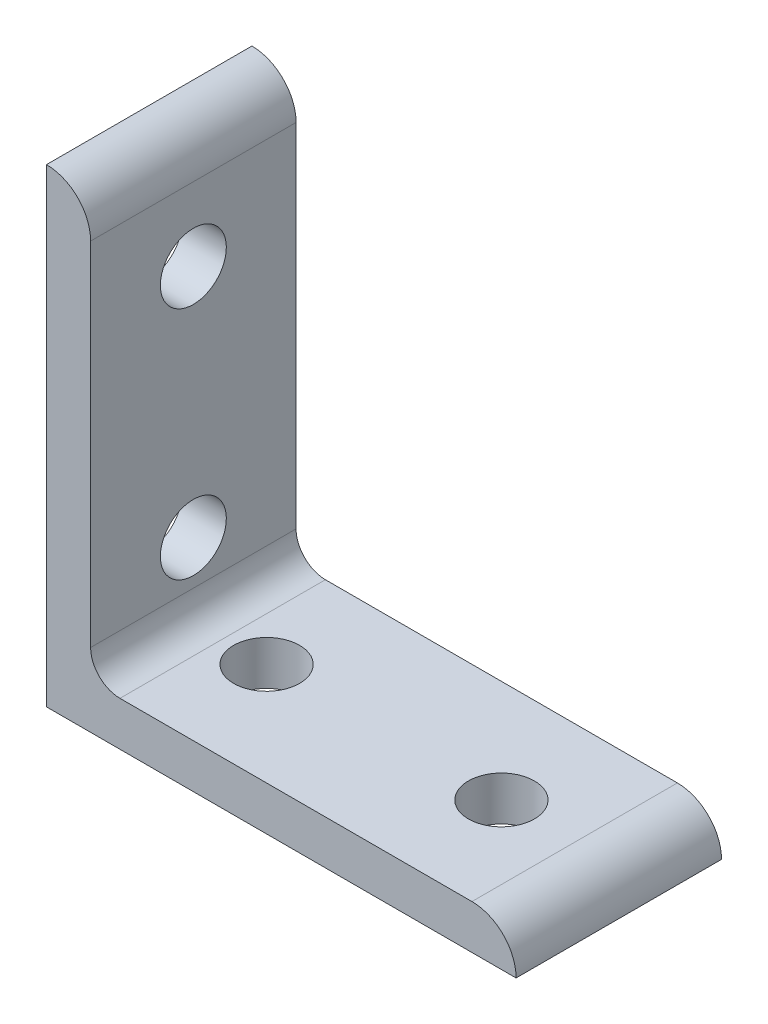
ISO-10303-21;
HEADER;
FILE_DESCRIPTION(('STEP AP214'),'2;1');
FILE_NAME('part.step','',(''),(''),'','','');
FILE_SCHEMA(('AUTOMOTIVE_DESIGN { 1 0 10303 214 1 1 1 1 }'));
ENDSEC;
DATA;
#1=APPLICATION_CONTEXT('core data for automotive mechanical design processes');
#2=APPLICATION_PROTOCOL_DEFINITION('international standard','automotive_design',2000,#1);
#3=PRODUCT_CONTEXT('',#1,'mechanical');
#4=PRODUCT('Part','Part','',(#3));
#5=PRODUCT_RELATED_PRODUCT_CATEGORY('part','',(#4));
#6=PRODUCT_DEFINITION_FORMATION('','',#4);
#7=PRODUCT_DEFINITION_CONTEXT('part definition',#1,'design');
#8=PRODUCT_DEFINITION('design','',#6,#7);
#9=PRODUCT_DEFINITION_SHAPE('','',#8);
#10=(LENGTH_UNIT() NAMED_UNIT(*) SI_UNIT(.MILLI.,.METRE.));
#11=(NAMED_UNIT(*) PLANE_ANGLE_UNIT() SI_UNIT($,.RADIAN.));
#12=(NAMED_UNIT(*) SI_UNIT($,.STERADIAN.) SOLID_ANGLE_UNIT());
#13=UNCERTAINTY_MEASURE_WITH_UNIT(LENGTH_MEASURE(1.E-05),#10,'distance_accuracy_value','');
#14=(GEOMETRIC_REPRESENTATION_CONTEXT(3) GLOBAL_UNCERTAINTY_ASSIGNED_CONTEXT((#13)) GLOBAL_UNIT_ASSIGNED_CONTEXT((#10,
#11,#12)) REPRESENTATION_CONTEXT('',''));
#15=CARTESIAN_POINT('',(0.,0.,0.));
#16=DIRECTION('',(0.,0.,1.));
#17=DIRECTION('',(1.,0.,0.));
#18=AXIS2_PLACEMENT_3D('',#15,#16,#17);
#19=CARTESIAN_POINT('',(4.7752,46.0248,11.1125));
#20=DIRECTION('',(-1.,0.,0.));
#21=DIRECTION('',(0.,-1.,0.));
#22=AXIS2_PLACEMENT_3D('',#19,#20,#21);
#23=PLANE('',#22);
#24=CARTESIAN_POINT('',(4.7752,12.7,0.));
#25=DIRECTION('',(-1.,0.,0.));
#26=DIRECTION('',(0.,-1.,0.));
#27=AXIS2_PLACEMENT_3D('',#24,#25,#26);
#28=CIRCLE('',#27,3.5687);
#29=CARTESIAN_POINT('',(4.7752,9.1313,0.));
#30=VERTEX_POINT('',#29);
#31=EDGE_CURVE('E199',#30,#30,#28,.F.);
#32=ORIENTED_EDGE('',*,*,#31,.F.);
#33=EDGE_LOOP('',(#32));
#34=FACE_BOUND('',#33,.T.);
#35=DIRECTION('',(0.,1.,0.));
#36=VECTOR('',#35,1.);
#37=CARTESIAN_POINT('',(4.7752,46.0248,-11.1125));
#38=LINE('',#37,#36);
#39=CARTESIAN_POINT('',(4.7752,7.9502,-11.1125));
#40=VERTEX_POINT('',#39);
#41=CARTESIAN_POINT('',(4.77519999999999,46.0248,-11.1125));
#42=VERTEX_POINT('',#41);
#43=EDGE_CURVE('E120',#40,#42,#38,.T.);
#44=ORIENTED_EDGE('',*,*,#43,.T.);
#45=DIRECTION('',(0.,0.,-1.));
#46=VECTOR('',#45,1.);
#47=CARTESIAN_POINT('',(4.77519999999999,46.0248,11.1125));
#48=LINE('',#47,#46);
#49=CARTESIAN_POINT('',(4.77519999999999,46.0248,11.1125));
#50=VERTEX_POINT('',#49);
#51=EDGE_CURVE('E117',#50,#42,#48,.T.);
#52=ORIENTED_EDGE('',*,*,#51,.F.);
#53=DIRECTION('',(0.,1.,0.));
#54=VECTOR('',#53,1.);
#55=CARTESIAN_POINT('',(4.7752,46.0248,11.1125));
#56=LINE('',#55,#54);
#57=CARTESIAN_POINT('',(4.7752,7.9502,11.1125));
#58=VERTEX_POINT('',#57);
#59=EDGE_CURVE('E106',#58,#50,#56,.T.);
#60=ORIENTED_EDGE('',*,*,#59,.F.);
#61=DIRECTION('',(0.,0.,-1.));
#62=VECTOR('',#61,1.);
#63=CARTESIAN_POINT('',(4.7752,7.9502,11.1125));
#64=LINE('',#63,#62);
#65=EDGE_CURVE('E121',#58,#40,#64,.T.);
#66=ORIENTED_EDGE('',*,*,#65,.T.);
#67=EDGE_LOOP('',(#44,#52,#60,#66));
#68=FACE_BOUND('',#67,.T.);
#69=CARTESIAN_POINT('',(4.77519999999999,38.1,0.));
#70=DIRECTION('',(-1.,0.,0.));
#71=DIRECTION('',(0.,-1.,0.));
#72=AXIS2_PLACEMENT_3D('',#69,#70,#71);
#73=CIRCLE('',#72,3.5687);
#74=CARTESIAN_POINT('',(4.77519999999999,34.5313,0.));
#75=VERTEX_POINT('',#74);
#76=EDGE_CURVE('E192',#75,#75,#73,.F.);
#77=ORIENTED_EDGE('',*,*,#76,.F.);
#78=EDGE_LOOP('',(#77));
#79=FACE_BOUND('',#78,.T.);
#80=ADVANCED_FACE('F37',(#34,#68,#79),#23,.F.);
#81=CARTESIAN_POINT('',(0.,0.,11.1125));
#82=DIRECTION('',(1.,0.,0.));
#83=DIRECTION('',(0.,0.,-1.));
#84=AXIS2_PLACEMENT_3D('',#81,#82,#83);
#85=PLANE('',#84);
#86=CARTESIAN_POINT('',(0.,12.7,0.));
#87=DIRECTION('',(1.,0.,0.));
#88=DIRECTION('',(0.,0.,-1.));
#89=AXIS2_PLACEMENT_3D('',#86,#87,#88);
#90=CIRCLE('',#89,3.5687);
#91=CARTESIAN_POINT('',(0.,12.7,-3.5687));
#92=VERTEX_POINT('',#91);
#93=EDGE_CURVE('E195',#92,#92,#90,.T.);
#94=ORIENTED_EDGE('',*,*,#93,.T.);
#95=EDGE_LOOP('',(#94));
#96=FACE_BOUND('',#95,.T.);
#97=DIRECTION('',(0.,-1.,0.));
#98=VECTOR('',#97,1.);
#99=CARTESIAN_POINT('',(0.,0.,-11.1125));
#100=LINE('',#99,#98);
#101=CARTESIAN_POINT('',(0.,50.8,-11.1125));
#102=VERTEX_POINT('',#101);
#103=CARTESIAN_POINT('',(0.,0.,-11.1125));
#104=VERTEX_POINT('',#103);
#105=EDGE_CURVE('E88',#102,#104,#100,.T.);
#106=ORIENTED_EDGE('',*,*,#105,.T.);
#107=DIRECTION('',(0.,0.,-1.));
#108=VECTOR('',#107,1.);
#109=CARTESIAN_POINT('',(0.,0.,11.1125));
#110=LINE('',#109,#108);
#111=CARTESIAN_POINT('',(0.,0.,11.1125));
#112=VERTEX_POINT('',#111);
#113=EDGE_CURVE('E126',#112,#104,#110,.T.);
#114=ORIENTED_EDGE('',*,*,#113,.F.);
#115=DIRECTION('',(0.,-1.,0.));
#116=VECTOR('',#115,1.);
#117=CARTESIAN_POINT('',(0.,0.,11.1125));
#118=LINE('',#117,#116);
#119=CARTESIAN_POINT('',(0.,50.8,11.1125));
#120=VERTEX_POINT('',#119);
#121=EDGE_CURVE('E56',#120,#112,#118,.T.);
#122=ORIENTED_EDGE('',*,*,#121,.F.);
#123=DIRECTION('',(0.,0.,-1.));
#124=VECTOR('',#123,1.);
#125=CARTESIAN_POINT('',(0.,50.8,11.1125));
#126=LINE('',#125,#124);
#127=EDGE_CURVE('E122',#120,#102,#126,.T.);
#128=ORIENTED_EDGE('',*,*,#127,.T.);
#129=EDGE_LOOP('',(#106,#114,#122,#128));
#130=FACE_BOUND('',#129,.T.);
#131=CARTESIAN_POINT('',(0.,38.1,0.));
#132=DIRECTION('',(1.,0.,0.));
#133=DIRECTION('',(0.,0.,-1.));
#134=AXIS2_PLACEMENT_3D('',#131,#132,#133);
#135=CIRCLE('',#134,3.5687);
#136=CARTESIAN_POINT('',(0.,38.1,-3.5687));
#137=VERTEX_POINT('',#136);
#138=EDGE_CURVE('E190',#137,#137,#135,.T.);
#139=ORIENTED_EDGE('',*,*,#138,.T.);
#140=EDGE_LOOP('',(#139));
#141=FACE_BOUND('',#140,.T.);
#142=ADVANCED_FACE('F183',(#96,#130,#141),#85,.F.);
#143=CARTESIAN_POINT('',(50.8,0.,11.1125));
#144=DIRECTION('',(0.,1.,0.));
#145=DIRECTION('',(-1.,0.,0.));
#146=AXIS2_PLACEMENT_3D('',#143,#144,#145);
#147=PLANE('',#146);
#148=CARTESIAN_POINT('',(12.7,0.,0.));
#149=DIRECTION('',(0.,1.,0.));
#150=DIRECTION('',(0.,0.,1.));
#151=AXIS2_PLACEMENT_3D('',#148,#149,#150);
#152=CIRCLE('',#151,3.5687);
#153=CARTESIAN_POINT('',(12.7,0.,3.5687));
#154=VERTEX_POINT('',#153);
#155=EDGE_CURVE('E152',#154,#154,#152,.T.);
#156=ORIENTED_EDGE('',*,*,#155,.T.);
#157=EDGE_LOOP('',(#156));
#158=FACE_BOUND('',#157,.T.);
#159=DIRECTION('',(1.,0.,0.));
#160=VECTOR('',#159,1.);
#161=CARTESIAN_POINT('',(50.8,0.,-11.1125));
#162=LINE('',#161,#160);
#163=CARTESIAN_POINT('',(50.8,0.,-11.1125));
#164=VERTEX_POINT('',#163);
#165=EDGE_CURVE('E130',#104,#164,#162,.T.);
#166=ORIENTED_EDGE('',*,*,#165,.T.);
#167=DIRECTION('',(0.,0.,-1.));
#168=VECTOR('',#167,1.);
#169=CARTESIAN_POINT('',(50.8,0.,11.1125));
#170=LINE('',#169,#168);
#171=CARTESIAN_POINT('',(50.8,0.,11.1125));
#172=VERTEX_POINT('',#171);
#173=EDGE_CURVE('E11',#172,#164,#170,.T.);
#174=ORIENTED_EDGE('',*,*,#173,.F.);
#175=DIRECTION('',(1.,0.,0.));
#176=VECTOR('',#175,1.);
#177=CARTESIAN_POINT('',(50.8,0.,11.1125));
#178=LINE('',#177,#176);
#179=EDGE_CURVE('E143',#112,#172,#178,.T.);
#180=ORIENTED_EDGE('',*,*,#179,.F.);
#181=ORIENTED_EDGE('',*,*,#113,.T.);
#182=EDGE_LOOP('',(#166,#174,#180,#181));
#183=FACE_BOUND('',#182,.T.);
#184=CARTESIAN_POINT('',(38.1,0.,0.));
#185=DIRECTION('',(0.,1.,0.));
#186=DIRECTION('',(0.,0.,1.));
#187=AXIS2_PLACEMENT_3D('',#184,#185,#186);
#188=CIRCLE('',#187,3.56869999999999);
#189=CARTESIAN_POINT('',(38.1,0.,3.56869999999999));
#190=VERTEX_POINT('',#189);
#191=EDGE_CURVE('E160',#190,#190,#188,.T.);
#192=ORIENTED_EDGE('',*,*,#191,.T.);
#193=EDGE_LOOP('',(#192));
#194=FACE_BOUND('',#193,.T.);
#195=ADVANCED_FACE('F39',(#158,#183,#194),#147,.F.);
#196=CARTESIAN_POINT('',(7.9502,4.7752,11.1125));
#197=DIRECTION('',(0.,-1.,0.));
#198=DIRECTION('',(1.,0.,0.));
#199=AXIS2_PLACEMENT_3D('',#196,#197,#198);
#200=PLANE('',#199);
#201=CARTESIAN_POINT('',(12.7,4.7752,0.));
#202=DIRECTION('',(0.,-1.,0.));
#203=DIRECTION('',(1.,0.,0.));
#204=AXIS2_PLACEMENT_3D('',#201,#202,#203);
#205=CIRCLE('',#204,3.5687);
#206=CARTESIAN_POINT('',(16.2687,4.7752,0.));
#207=VERTEX_POINT('',#206);
#208=EDGE_CURVE('E134',#207,#207,#205,.F.);
#209=ORIENTED_EDGE('',*,*,#208,.F.);
#210=EDGE_LOOP('',(#209));
#211=FACE_BOUND('',#210,.T.);
#212=DIRECTION('',(-1.,0.,0.));
#213=VECTOR('',#212,1.);
#214=CARTESIAN_POINT('',(7.9502,4.7752,-11.1125));
#215=LINE('',#214,#213);
#216=CARTESIAN_POINT('',(46.0248,4.7752,-11.1125));
#217=VERTEX_POINT('',#216);
#218=CARTESIAN_POINT('',(7.9502,4.7752,-11.1125));
#219=VERTEX_POINT('',#218);
#220=EDGE_CURVE('E136',#217,#219,#215,.T.);
#221=ORIENTED_EDGE('',*,*,#220,.T.);
#222=DIRECTION('',(0.,0.,-1.));
#223=VECTOR('',#222,1.);
#224=CARTESIAN_POINT('',(7.9502,4.7752,11.1125));
#225=LINE('',#224,#223);
#226=CARTESIAN_POINT('',(7.9502,4.7752,11.1125));
#227=VERTEX_POINT('',#226);
#228=EDGE_CURVE('E147',#227,#219,#225,.T.);
#229=ORIENTED_EDGE('',*,*,#228,.F.);
#230=DIRECTION('',(-1.,0.,0.));
#231=VECTOR('',#230,1.);
#232=CARTESIAN_POINT('',(7.9502,4.7752,11.1125));
#233=LINE('',#232,#231);
#234=CARTESIAN_POINT('',(46.0248,4.7752,11.1125));
#235=VERTEX_POINT('',#234);
#236=EDGE_CURVE('E166',#235,#227,#233,.T.);
#237=ORIENTED_EDGE('',*,*,#236,.F.);
#238=DIRECTION('',(0.,0.,-1.));
#239=VECTOR('',#238,1.);
#240=CARTESIAN_POINT('',(46.0248,4.7752,11.1125));
#241=LINE('',#240,#239);
#242=EDGE_CURVE('E47',#235,#217,#241,.T.);
#243=ORIENTED_EDGE('',*,*,#242,.T.);
#244=EDGE_LOOP('',(#221,#229,#237,#243));
#245=FACE_BOUND('',#244,.T.);
#246=CARTESIAN_POINT('',(38.1,4.7752,0.));
#247=DIRECTION('',(0.,-1.,0.));
#248=DIRECTION('',(1.,0.,0.));
#249=AXIS2_PLACEMENT_3D('',#246,#247,#248);
#250=CIRCLE('',#249,3.56869999999999);
#251=CARTESIAN_POINT('',(41.6687,4.7752,0.));
#252=VERTEX_POINT('',#251);
#253=EDGE_CURVE('E41',#252,#252,#250,.F.);
#254=ORIENTED_EDGE('',*,*,#253,.F.);
#255=EDGE_LOOP('',(#254));
#256=FACE_BOUND('',#255,.T.);
#257=ADVANCED_FACE('F170',(#211,#245,#256),#200,.F.);
#258=CARTESIAN_POINT('',(46.0248,0.,11.1125));
#259=DIRECTION('',(0.,0.,-1.));
#260=DIRECTION('',(-1.,0.,0.));
#261=AXIS2_PLACEMENT_3D('',#258,#259,#260);
#262=CYLINDRICAL_SURFACE('',#261,4.7752);
#263=CARTESIAN_POINT('',(46.0248,0.,-11.1125));
#264=DIRECTION('',(0.,0.,1.));
#265=DIRECTION('',(1.,0.,0.));
#266=AXIS2_PLACEMENT_3D('',#263,#264,#265);
#267=CIRCLE('',#266,4.7752);
#268=EDGE_CURVE('E133',#164,#217,#267,.T.);
#269=ORIENTED_EDGE('',*,*,#268,.T.);
#270=ORIENTED_EDGE('',*,*,#242,.F.);
#271=CARTESIAN_POINT('',(46.0248,0.,11.1125));
#272=DIRECTION('',(0.,0.,1.));
#273=DIRECTION('',(1.,0.,0.));
#274=AXIS2_PLACEMENT_3D('',#271,#272,#273);
#275=CIRCLE('',#274,4.7752);
#276=EDGE_CURVE('E96',#172,#235,#275,.T.);
#277=ORIENTED_EDGE('',*,*,#276,.F.);
#278=ORIENTED_EDGE('',*,*,#173,.T.);
#279=EDGE_LOOP('',(#269,#270,#277,#278));
#280=FACE_BOUND('',#279,.T.);
#281=ADVANCED_FACE('F214',(#280),#262,.T.);
#282=CARTESIAN_POINT('',(7.9502,7.9502,11.1125));
#283=DIRECTION('',(0.,0.,-1.));
#284=DIRECTION('',(-1.,0.,0.));
#285=AXIS2_PLACEMENT_3D('',#282,#283,#284);
#286=CYLINDRICAL_SURFACE('',#285,3.175);
#287=CARTESIAN_POINT('',(7.9502,7.9502,-11.1125));
#288=DIRECTION('',(0.,0.,-1.));
#289=DIRECTION('',(1.,0.,0.));
#290=AXIS2_PLACEMENT_3D('',#287,#288,#289);
#291=CIRCLE('',#290,3.175);
#292=EDGE_CURVE('E138',#219,#40,#291,.T.);
#293=ORIENTED_EDGE('',*,*,#292,.T.);
#294=ORIENTED_EDGE('',*,*,#65,.F.);
#295=CARTESIAN_POINT('',(7.9502,7.9502,11.1125));
#296=DIRECTION('',(0.,0.,-1.));
#297=DIRECTION('',(1.,0.,0.));
#298=AXIS2_PLACEMENT_3D('',#295,#296,#297);
#299=CIRCLE('',#298,3.175);
#300=EDGE_CURVE('E112',#227,#58,#299,.T.);
#301=ORIENTED_EDGE('',*,*,#300,.F.);
#302=ORIENTED_EDGE('',*,*,#228,.T.);
#303=EDGE_LOOP('',(#293,#294,#301,#302));
#304=FACE_BOUND('',#303,.T.);
#305=ADVANCED_FACE('F175',(#304),#286,.F.);
#306=CARTESIAN_POINT('',(0.,46.0248,11.1125));
#307=DIRECTION('',(0.,0.,-1.));
#308=DIRECTION('',(-1.,0.,0.));
#309=AXIS2_PLACEMENT_3D('',#306,#307,#308);
#310=CYLINDRICAL_SURFACE('',#309,4.77519999999999);
#311=CARTESIAN_POINT('',(0.,46.0248,-11.1125));
#312=DIRECTION('',(0.,0.,1.));
#313=DIRECTION('',(1.,0.,0.));
#314=AXIS2_PLACEMENT_3D('',#311,#312,#313);
#315=CIRCLE('',#314,4.77519999999999);
#316=EDGE_CURVE('E82',#42,#102,#315,.T.);
#317=ORIENTED_EDGE('',*,*,#316,.T.);
#318=ORIENTED_EDGE('',*,*,#127,.F.);
#319=CARTESIAN_POINT('',(0.,46.0248,11.1125));
#320=DIRECTION('',(0.,0.,1.));
#321=DIRECTION('',(1.,0.,0.));
#322=AXIS2_PLACEMENT_3D('',#319,#320,#321);
#323=CIRCLE('',#322,4.77519999999999);
#324=EDGE_CURVE('E110',#50,#120,#323,.T.);
#325=ORIENTED_EDGE('',*,*,#324,.F.);
#326=ORIENTED_EDGE('',*,*,#51,.T.);
#327=EDGE_LOOP('',(#317,#318,#325,#326));
#328=FACE_BOUND('',#327,.T.);
#329=ADVANCED_FACE('F124',(#328),#310,.T.);
#330=CARTESIAN_POINT('',(0.,46.0248,11.1125));
#331=DIRECTION('',(0.,0.,1.));
#332=DIRECTION('',(1.,0.,0.));
#333=AXIS2_PLACEMENT_3D('',#330,#331,#332);
#334=PLANE('',#333);
#335=ORIENTED_EDGE('',*,*,#179,.T.);
#336=ORIENTED_EDGE('',*,*,#276,.T.);
#337=ORIENTED_EDGE('',*,*,#236,.T.);
#338=ORIENTED_EDGE('',*,*,#300,.T.);
#339=ORIENTED_EDGE('',*,*,#59,.T.);
#340=ORIENTED_EDGE('',*,*,#324,.T.);
#341=ORIENTED_EDGE('',*,*,#121,.T.);
#342=EDGE_LOOP('',(#335,#336,#337,#338,#339,#340,#341));
#343=FACE_BOUND('',#342,.T.);
#344=ADVANCED_FACE('F108',(#343),#334,.T.);
#345=CARTESIAN_POINT('',(0.,46.0248,-11.1125));
#346=DIRECTION('',(0.,0.,1.));
#347=DIRECTION('',(1.,0.,0.));
#348=AXIS2_PLACEMENT_3D('',#345,#346,#347);
#349=PLANE('',#348);
#350=ORIENTED_EDGE('',*,*,#165,.F.);
#351=ORIENTED_EDGE('',*,*,#105,.F.);
#352=ORIENTED_EDGE('',*,*,#316,.F.);
#353=ORIENTED_EDGE('',*,*,#43,.F.);
#354=ORIENTED_EDGE('',*,*,#292,.F.);
#355=ORIENTED_EDGE('',*,*,#220,.F.);
#356=ORIENTED_EDGE('',*,*,#268,.F.);
#357=EDGE_LOOP('',(#350,#351,#352,#353,#354,#355,#356));
#358=FACE_BOUND('',#357,.T.);
#359=ADVANCED_FACE('F178',(#358),#349,.F.);
#360=CARTESIAN_POINT('',(12.7,50.8,0.));
#361=DIRECTION('',(0.,-1.,0.));
#362=DIRECTION('',(0.,0.,-1.));
#363=AXIS2_PLACEMENT_3D('',#360,#361,#362);
#364=CYLINDRICAL_SURFACE('',#363,3.5687);
#365=ORIENTED_EDGE('',*,*,#155,.F.);
#366=EDGE_LOOP('',(#365));
#367=FACE_BOUND('',#366,.T.);
#368=ORIENTED_EDGE('',*,*,#208,.T.);
#369=EDGE_LOOP('',(#368));
#370=FACE_BOUND('',#369,.T.);
#371=ADVANCED_FACE('F210',(#367,#370),#364,.F.);
#372=CARTESIAN_POINT('',(38.1,50.8,0.));
#373=DIRECTION('',(0.,-1.,0.));
#374=DIRECTION('',(0.,0.,-1.));
#375=AXIS2_PLACEMENT_3D('',#372,#373,#374);
#376=CYLINDRICAL_SURFACE('',#375,3.56869999999999);
#377=ORIENTED_EDGE('',*,*,#191,.F.);
#378=EDGE_LOOP('',(#377));
#379=FACE_BOUND('',#378,.T.);
#380=ORIENTED_EDGE('',*,*,#253,.T.);
#381=EDGE_LOOP('',(#380));
#382=FACE_BOUND('',#381,.T.);
#383=ADVANCED_FACE('F206',(#379,#382),#376,.F.);
#384=CARTESIAN_POINT('',(50.8,12.7,0.));
#385=DIRECTION('',(-1.,0.,0.));
#386=DIRECTION('',(0.,0.,1.));
#387=AXIS2_PLACEMENT_3D('',#384,#385,#386);
#388=CYLINDRICAL_SURFACE('',#387,3.5687);
#389=ORIENTED_EDGE('',*,*,#93,.F.);
#390=EDGE_LOOP('',(#389));
#391=FACE_BOUND('',#390,.T.);
#392=ORIENTED_EDGE('',*,*,#31,.T.);
#393=EDGE_LOOP('',(#392));
#394=FACE_BOUND('',#393,.T.);
#395=ADVANCED_FACE('F209',(#391,#394),#388,.F.);
#396=CARTESIAN_POINT('',(50.8,38.1,0.));
#397=DIRECTION('',(-1.,0.,0.));
#398=DIRECTION('',(0.,0.,1.));
#399=AXIS2_PLACEMENT_3D('',#396,#397,#398);
#400=CYLINDRICAL_SURFACE('',#399,3.5687);
#401=ORIENTED_EDGE('',*,*,#138,.F.);
#402=EDGE_LOOP('',(#401));
#403=FACE_BOUND('',#402,.T.);
#404=ORIENTED_EDGE('',*,*,#76,.T.);
#405=EDGE_LOOP('',(#404));
#406=FACE_BOUND('',#405,.T.);
#407=ADVANCED_FACE('F246',(#403,#406),#400,.F.);
#408=CLOSED_SHELL('',(#80,#142,#195,#257,#281,#305,#329,#344,#359,#371,#383,#395,#407));
#409=MANIFOLD_SOLID_BREP('B2',#408);
#410=ADVANCED_BREP_SHAPE_REPRESENTATION('',(#18,#409),#14);
#411=SHAPE_DEFINITION_REPRESENTATION(#9,#410);
ENDSEC;
END-ISO-10303-21;
